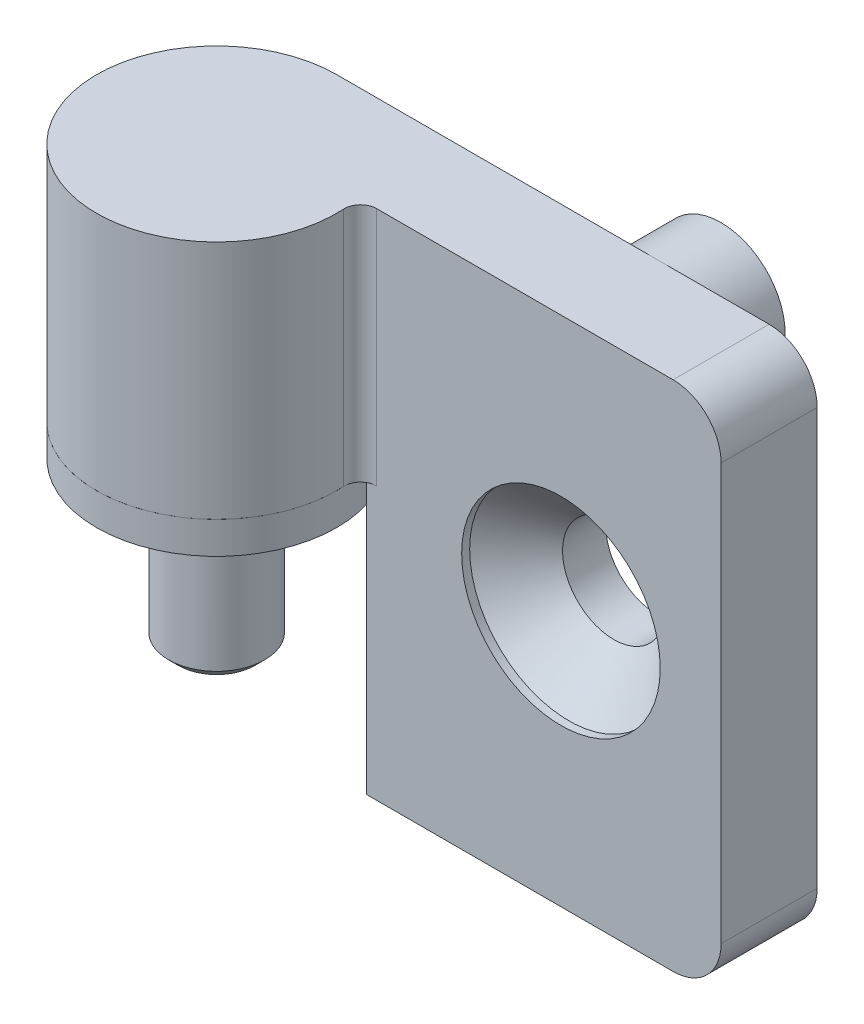
ISO-10303-21;
HEADER;
FILE_DESCRIPTION(('STEP AP214'),'2;1');
FILE_NAME('part.step','',(''),(''),'','','');
FILE_SCHEMA(('AUTOMOTIVE_DESIGN { 1 0 10303 214 1 1 1 1 }'));
ENDSEC;
DATA;
#1=APPLICATION_CONTEXT('core data for automotive mechanical design processes');
#2=APPLICATION_PROTOCOL_DEFINITION('international standard','automotive_design',2000,#1);
#3=PRODUCT_CONTEXT('',#1,'mechanical');
#4=PRODUCT('Part','Part','',(#3));
#5=PRODUCT_RELATED_PRODUCT_CATEGORY('part','',(#4));
#6=PRODUCT_DEFINITION_FORMATION('','',#4);
#7=PRODUCT_DEFINITION_CONTEXT('part definition',#1,'design');
#8=PRODUCT_DEFINITION('design','',#6,#7);
#9=PRODUCT_DEFINITION_SHAPE('','',#8);
#10=(LENGTH_UNIT() NAMED_UNIT(*) SI_UNIT(.MILLI.,.METRE.));
#11=(NAMED_UNIT(*) PLANE_ANGLE_UNIT() SI_UNIT($,.RADIAN.));
#12=(NAMED_UNIT(*) SI_UNIT($,.STERADIAN.) SOLID_ANGLE_UNIT());
#13=UNCERTAINTY_MEASURE_WITH_UNIT(LENGTH_MEASURE(1.E-05),#10,'distance_accuracy_value','');
#14=(GEOMETRIC_REPRESENTATION_CONTEXT(3) GLOBAL_UNCERTAINTY_ASSIGNED_CONTEXT((#13)) GLOBAL_UNIT_ASSIGNED_CONTEXT((#10,
#11,#12)) REPRESENTATION_CONTEXT('',''));
#15=CARTESIAN_POINT('',(0.,0.,0.));
#16=DIRECTION('',(0.,0.,1.));
#17=DIRECTION('',(1.,0.,0.));
#18=AXIS2_PLACEMENT_3D('',#15,#16,#17);
#19=CARTESIAN_POINT('',(0.,-11.,0.));
#20=DIRECTION('',(0.,-1.,0.));
#21=DIRECTION('',(0.,0.,-1.));
#22=AXIS2_PLACEMENT_3D('',#19,#20,#21);
#23=PLANE('',#22);
#24=CARTESIAN_POINT('',(0.,-11.0000000000241,0.));
#25=DIRECTION('',(0.,1.,0.));
#26=DIRECTION('',(0.,0.,1.));
#27=AXIS2_PLACEMENT_3D('',#24,#25,#26);
#28=CIRCLE('',#27,2.39999999996598);
#29=CARTESIAN_POINT('',(0.,-11.0000000000241,2.39999999996598));
#30=VERTEX_POINT('',#29);
#31=EDGE_CURVE('P0_E18',#30,#30,#28,.T.);
#32=ORIENTED_EDGE('',*,*,#31,.F.);
#33=EDGE_LOOP('',(#32));
#34=FACE_BOUND('',#33,.T.);
#35=ADVANCED_FACE('P0_F15',(#34),#23,.T.);
#36=CARTESIAN_POINT('',(0.,11.,0.));
#37=DIRECTION('',(0.,-1.,0.));
#38=DIRECTION('',(0.,0.,-1.));
#39=AXIS2_PLACEMENT_3D('',#36,#37,#38);
#40=PLANE('',#39);
#41=CARTESIAN_POINT('',(0.,11.0000000000241,0.));
#42=DIRECTION('',(0.,-1.,0.));
#43=DIRECTION('',(0.,0.,-1.));
#44=AXIS2_PLACEMENT_3D('',#41,#42,#43);
#45=CIRCLE('',#44,2.39999999996598);
#46=CARTESIAN_POINT('',(0.,11.0000000000241,-2.39999999996598));
#47=VERTEX_POINT('',#46);
#48=EDGE_CURVE('P0_E27',#47,#47,#45,.T.);
#49=ORIENTED_EDGE('',*,*,#48,.F.);
#50=EDGE_LOOP('',(#49));
#51=FACE_BOUND('',#50,.T.);
#52=ADVANCED_FACE('P0_F42',(#51),#40,.F.);
#53=CARTESIAN_POINT('',(0.,-10.400000000061,0.));
#54=DIRECTION('',(0.,1.,0.));
#55=DIRECTION('',(0.,0.,1.));
#56=AXIS2_PLACEMENT_3D('',#53,#54,#55);
#57=CONICAL_SURFACE('',#56,2.99999999992906,0.785398163397448);
#58=CARTESIAN_POINT('',(0.,-10.4,0.));
#59=DIRECTION('',(0.,1.,0.));
#60=DIRECTION('',(0.,0.,1.));
#61=AXIS2_PLACEMENT_3D('',#58,#59,#60);
#62=CIRCLE('',#61,3.);
#63=CARTESIAN_POINT('',(0.,-10.4,3.));
#64=VERTEX_POINT('',#63);
#65=EDGE_CURVE('P0_E22',#64,#64,#62,.T.);
#66=ORIENTED_EDGE('',*,*,#65,.F.);
#67=EDGE_LOOP('',(#66));
#68=FACE_BOUND('',#67,.T.);
#69=ORIENTED_EDGE('',*,*,#31,.T.);
#70=EDGE_LOOP('',(#69));
#71=FACE_BOUND('',#70,.T.);
#72=ADVANCED_FACE('P0_F39',(#68,#71),#57,.T.);
#73=CARTESIAN_POINT('',(0.,10.4000000000042,0.));
#74=DIRECTION('',(0.,-1.,0.));
#75=DIRECTION('',(0.,0.,-1.));
#76=AXIS2_PLACEMENT_3D('',#73,#74,#75);
#77=CONICAL_SURFACE('',#76,2.9999999999859,0.785398163397448);
#78=CARTESIAN_POINT('',(0.,10.4,0.));
#79=DIRECTION('',(0.,1.,0.));
#80=DIRECTION('',(0.,0.,1.));
#81=AXIS2_PLACEMENT_3D('',#78,#79,#80);
#82=CIRCLE('',#81,3.);
#83=CARTESIAN_POINT('',(0.,10.4,3.));
#84=VERTEX_POINT('',#83);
#85=EDGE_CURVE('P0_E10',#84,#84,#82,.F.);
#86=ORIENTED_EDGE('',*,*,#85,.F.);
#87=EDGE_LOOP('',(#86));
#88=FACE_BOUND('',#87,.T.);
#89=ORIENTED_EDGE('',*,*,#48,.T.);
#90=EDGE_LOOP('',(#89));
#91=FACE_BOUND('',#90,.T.);
#92=ADVANCED_FACE('P0_F50',(#88,#91),#77,.T.);
#93=CARTESIAN_POINT('',(0.,-11.,0.));
#94=DIRECTION('',(0.,1.,0.));
#95=DIRECTION('',(0.,0.,1.));
#96=AXIS2_PLACEMENT_3D('',#93,#94,#95);
#97=CYLINDRICAL_SURFACE('',#96,3.);
#98=ORIENTED_EDGE('',*,*,#85,.T.);
#99=EDGE_LOOP('',(#98));
#100=FACE_BOUND('',#99,.T.);
#101=ORIENTED_EDGE('',*,*,#65,.T.);
#102=EDGE_LOOP('',(#101));
#103=FACE_BOUND('',#102,.T.);
#104=ADVANCED_FACE('P0_F48',(#100,#103),#97,.T.);
#105=CLOSED_SHELL('',(#35,#52,#72,#92,#104));
#106=MANIFOLD_SOLID_BREP('P0_B1',#105);
#107=CARTESIAN_POINT('',(0.,1.,0.));
#108=DIRECTION('',(0.,-1.,0.));
#109=DIRECTION('',(0.,0.,-1.));
#110=AXIS2_PLACEMENT_3D('',#107,#108,#109);
#111=PLANE('',#110);
#112=CARTESIAN_POINT('',(0.,1.,0.));
#113=DIRECTION('',(0.,-1.,0.));
#114=DIRECTION('',(0.,0.,-1.));
#115=AXIS2_PLACEMENT_3D('',#112,#113,#114);
#116=CIRCLE('',#115,3.);
#117=CARTESIAN_POINT('',(0.,1.,-3.));
#118=VERTEX_POINT('',#117);
#119=EDGE_CURVE('P1_E26',#118,#118,#116,.T.);
#120=ORIENTED_EDGE('',*,*,#119,.T.);
#121=EDGE_LOOP('',(#120));
#122=FACE_BOUND('',#121,.T.);
#123=CARTESIAN_POINT('',(0.,1.,0.));
#124=DIRECTION('',(0.,1.,0.));
#125=DIRECTION('',(0.,0.,1.));
#126=AXIS2_PLACEMENT_3D('',#123,#124,#125);
#127=CIRCLE('',#126,7.5);
#128=CARTESIAN_POINT('',(0.,1.,7.5));
#129=VERTEX_POINT('',#128);
#130=EDGE_CURVE('P1_E17',#129,#129,#127,.F.);
#131=ORIENTED_EDGE('',*,*,#130,.F.);
#132=EDGE_LOOP('',(#131));
#133=FACE_BOUND('',#132,.T.);
#134=ADVANCED_FACE('P1_F14',(#122,#133),#111,.F.);
#135=CARTESIAN_POINT('',(0.,-1.,0.));
#136=DIRECTION('',(0.,1.,0.));
#137=DIRECTION('',(0.,0.,1.));
#138=AXIS2_PLACEMENT_3D('',#135,#136,#137);
#139=CYLINDRICAL_SURFACE('',#138,7.5);
#140=ORIENTED_EDGE('',*,*,#130,.T.);
#141=EDGE_LOOP('',(#140));
#142=FACE_BOUND('',#141,.T.);
#143=CARTESIAN_POINT('',(0.,-1.,0.));
#144=DIRECTION('',(0.,1.,0.));
#145=DIRECTION('',(0.,0.,1.));
#146=AXIS2_PLACEMENT_3D('',#143,#144,#145);
#147=CIRCLE('',#146,7.5);
#148=CARTESIAN_POINT('',(0.,-1.,7.5));
#149=VERTEX_POINT('',#148);
#150=EDGE_CURVE('P1_E21',#149,#149,#147,.F.);
#151=ORIENTED_EDGE('',*,*,#150,.F.);
#152=EDGE_LOOP('',(#151));
#153=FACE_BOUND('',#152,.T.);
#154=ADVANCED_FACE('P1_F34',(#142,#153),#139,.T.);
#155=CARTESIAN_POINT('',(0.,2.,0.));
#156=DIRECTION('',(0.,-1.,0.));
#157=DIRECTION('',(0.,0.,-1.));
#158=AXIS2_PLACEMENT_3D('',#155,#156,#157);
#159=CYLINDRICAL_SURFACE('',#158,3.);
#160=CARTESIAN_POINT('',(0.,-1.,0.));
#161=DIRECTION('',(0.,-1.,0.));
#162=DIRECTION('',(0.,0.,-1.));
#163=AXIS2_PLACEMENT_3D('',#160,#161,#162);
#164=CIRCLE('',#163,3.);
#165=CARTESIAN_POINT('',(0.,-1.,-3.));
#166=VERTEX_POINT('',#165);
#167=EDGE_CURVE('P1_E10',#166,#166,#164,.F.);
#168=ORIENTED_EDGE('',*,*,#167,.F.);
#169=EDGE_LOOP('',(#168));
#170=FACE_BOUND('',#169,.T.);
#171=ORIENTED_EDGE('',*,*,#119,.F.);
#172=EDGE_LOOP('',(#171));
#173=FACE_BOUND('',#172,.T.);
#174=ADVANCED_FACE('P1_F42',(#170,#173),#159,.F.);
#175=CARTESIAN_POINT('',(0.,-1.,0.));
#176=DIRECTION('',(0.,-1.,0.));
#177=DIRECTION('',(0.,0.,-1.));
#178=AXIS2_PLACEMENT_3D('',#175,#176,#177);
#179=PLANE('',#178);
#180=ORIENTED_EDGE('',*,*,#167,.T.);
#181=EDGE_LOOP('',(#180));
#182=FACE_BOUND('',#181,.T.);
#183=ORIENTED_EDGE('',*,*,#150,.T.);
#184=EDGE_LOOP('',(#183));
#185=FACE_BOUND('',#184,.T.);
#186=ADVANCED_FACE('P1_F43',(#182,#185),#179,.T.);
#187=CLOSED_SHELL('',(#134,#154,#174,#186));
#188=MANIFOLD_SOLID_BREP('P1_B1',#187);
#189=CARTESIAN_POINT('',(20.,-12.,-11.5));
#190=DIRECTION('',(0.,0.,1.));
#191=DIRECTION('',(1.,0.,0.));
#192=AXIS2_PLACEMENT_3D('',#189,#190,#191);
#193=CYLINDRICAL_SURFACE('',#192,4.);
#194=CARTESIAN_POINT('',(20.,-12.,-7.5));
#195=DIRECTION('',(0.,0.,1.));
#196=DIRECTION('',(1.,0.,0.));
#197=AXIS2_PLACEMENT_3D('',#194,#195,#196);
#198=CIRCLE('',#197,4.);
#199=CARTESIAN_POINT('',(16.2919007564522,-10.5,-7.5));
#200=VERTEX_POINT('',#199);
#201=CARTESIAN_POINT('',(20.,-16.,-7.5));
#202=VERTEX_POINT('',#201);
#203=EDGE_CURVE('P2_E140',#200,#202,#198,.T.);
#204=ORIENTED_EDGE('',*,*,#203,.F.);
#205=DIRECTION('',(0.,0.,1.));
#206=VECTOR('',#205,1.);
#207=CARTESIAN_POINT('',(16.2919007564522,-10.5,-11.5));
#208=LINE('',#207,#206);
#209=CARTESIAN_POINT('',(16.2919007564522,-10.5,-11.5));
#210=VERTEX_POINT('',#209);
#211=EDGE_CURVE('P2_E102',#200,#210,#208,.F.);
#212=ORIENTED_EDGE('',*,*,#211,.T.);
#213=CARTESIAN_POINT('',(20.,-12.,-11.5));
#214=DIRECTION('',(0.,0.,1.));
#215=DIRECTION('',(1.,0.,0.));
#216=AXIS2_PLACEMENT_3D('',#213,#214,#215);
#217=CIRCLE('',#216,4.);
#218=CARTESIAN_POINT('',(23.7080992435478,-10.5,-11.5));
#219=VERTEX_POINT('',#218);
#220=EDGE_CURVE('P2_E105',#210,#219,#217,.T.);
#221=ORIENTED_EDGE('',*,*,#220,.T.);
#222=DIRECTION('',(0.,0.,1.));
#223=VECTOR('',#222,1.);
#224=CARTESIAN_POINT('',(23.7080992435478,-10.5,-11.5));
#225=LINE('',#224,#223);
#226=CARTESIAN_POINT('',(23.7080992435478,-10.5,-7.5));
#227=VERTEX_POINT('',#226);
#228=EDGE_CURVE('P2_E108',#219,#227,#225,.T.);
#229=ORIENTED_EDGE('',*,*,#228,.T.);
#230=CARTESIAN_POINT('',(20.,-12.,-7.5));
#231=DIRECTION('',(0.,0.,1.));
#232=DIRECTION('',(1.,0.,0.));
#233=AXIS2_PLACEMENT_3D('',#230,#231,#232);
#234=CIRCLE('',#233,4.);
#235=EDGE_CURVE('P2_E138',#202,#227,#234,.T.);
#236=ORIENTED_EDGE('',*,*,#235,.F.);
#237=EDGE_LOOP('',(#204,#212,#221,#229,#236));
#238=FACE_BOUND('',#237,.T.);
#239=ADVANCED_FACE('P2_F16',(#238),#193,.T.);
#240=CARTESIAN_POINT('',(23.7080992435478,-10.5,-11.5));
#241=DIRECTION('',(0.,1.,0.));
#242=DIRECTION('',(0.,0.,1.));
#243=AXIS2_PLACEMENT_3D('',#240,#241,#242);
#244=PLANE('',#243);
#245=DIRECTION('',(1.,0.,0.));
#246=VECTOR('',#245,1.);
#247=CARTESIAN_POINT('',(23.7080992435478,-10.5,-11.5));
#248=LINE('',#247,#246);
#249=EDGE_CURVE('P2_E115',#219,#210,#248,.F.);
#250=ORIENTED_EDGE('',*,*,#249,.T.);
#251=ORIENTED_EDGE('',*,*,#211,.F.);
#252=DIRECTION('',(1.,0.,0.));
#253=VECTOR('',#252,1.);
#254=CARTESIAN_POINT('',(20.,-10.5,-7.5));
#255=LINE('',#254,#253);
#256=EDGE_CURVE('P2_E20',#200,#227,#255,.T.);
#257=ORIENTED_EDGE('',*,*,#256,.T.);
#258=ORIENTED_EDGE('',*,*,#228,.F.);
#259=EDGE_LOOP('',(#250,#251,#257,#258));
#260=FACE_BOUND('',#259,.T.);
#261=ADVANCED_FACE('P2_F114',(#260),#244,.T.);
#262=CARTESIAN_POINT('',(20.,-12.,-11.5));
#263=DIRECTION('',(0.,0.,1.));
#264=DIRECTION('',(1.,0.,0.));
#265=AXIS2_PLACEMENT_3D('',#262,#263,#264);
#266=PLANE('',#265);
#267=ORIENTED_EDGE('',*,*,#249,.F.);
#268=ORIENTED_EDGE('',*,*,#220,.F.);
#269=EDGE_LOOP('',(#267,#268));
#270=FACE_BOUND('',#269,.T.);
#271=ADVANCED_FACE('P2_F18',(#270),#266,.F.);
#272=CARTESIAN_POINT('',(20.,12.,-11.5));
#273=DIRECTION('',(0.,0.,1.));
#274=DIRECTION('',(1.,0.,0.));
#275=AXIS2_PLACEMENT_3D('',#272,#273,#274);
#276=CYLINDRICAL_SURFACE('',#275,4.);
#277=CARTESIAN_POINT('',(20.,12.,-7.5));
#278=DIRECTION('',(0.,0.,1.));
#279=DIRECTION('',(1.,0.,0.));
#280=AXIS2_PLACEMENT_3D('',#277,#278,#279);
#281=CIRCLE('',#280,4.);
#282=CARTESIAN_POINT('',(23.7080992435478,10.5,-7.5));
#283=VERTEX_POINT('',#282);
#284=CARTESIAN_POINT('',(20.,16.,-7.5));
#285=VERTEX_POINT('',#284);
#286=EDGE_CURVE('P2_E128',#283,#285,#281,.T.);
#287=ORIENTED_EDGE('',*,*,#286,.F.);
#288=DIRECTION('',(0.,0.,1.));
#289=VECTOR('',#288,1.);
#290=CARTESIAN_POINT('',(23.7080992435478,10.5,-11.5));
#291=LINE('',#290,#289);
#292=CARTESIAN_POINT('',(23.7080992435478,10.5,-11.5));
#293=VERTEX_POINT('',#292);
#294=EDGE_CURVE('P2_E117',#283,#293,#291,.F.);
#295=ORIENTED_EDGE('',*,*,#294,.T.);
#296=CARTESIAN_POINT('',(20.,12.,-11.5));
#297=DIRECTION('',(0.,0.,1.));
#298=DIRECTION('',(1.,0.,0.));
#299=AXIS2_PLACEMENT_3D('',#296,#297,#298);
#300=CIRCLE('',#299,4.);
#301=CARTESIAN_POINT('',(16.2919007564522,10.5,-11.5));
#302=VERTEX_POINT('',#301);
#303=EDGE_CURVE('P2_E119',#293,#302,#300,.T.);
#304=ORIENTED_EDGE('',*,*,#303,.T.);
#305=DIRECTION('',(0.,0.,1.));
#306=VECTOR('',#305,1.);
#307=CARTESIAN_POINT('',(16.2919007564522,10.5,-11.5));
#308=LINE('',#307,#306);
#309=CARTESIAN_POINT('',(16.2919007564522,10.5,-7.5));
#310=VERTEX_POINT('',#309);
#311=EDGE_CURVE('P2_E221',#302,#310,#308,.T.);
#312=ORIENTED_EDGE('',*,*,#311,.T.);
#313=CARTESIAN_POINT('',(20.,12.,-7.5));
#314=DIRECTION('',(0.,0.,1.));
#315=DIRECTION('',(1.,0.,0.));
#316=AXIS2_PLACEMENT_3D('',#313,#314,#315);
#317=CIRCLE('',#316,4.);
#318=EDGE_CURVE('P2_E124',#285,#310,#317,.T.);
#319=ORIENTED_EDGE('',*,*,#318,.F.);
#320=EDGE_LOOP('',(#287,#295,#304,#312,#319));
#321=FACE_BOUND('',#320,.T.);
#322=ADVANCED_FACE('P2_F219',(#321),#276,.T.);
#323=CARTESIAN_POINT('',(16.2919007564522,10.5,-11.5));
#324=DIRECTION('',(0.,-1.,0.));
#325=DIRECTION('',(0.,0.,-1.));
#326=AXIS2_PLACEMENT_3D('',#323,#324,#325);
#327=PLANE('',#326);
#328=DIRECTION('',(1.,0.,0.));
#329=VECTOR('',#328,1.);
#330=CARTESIAN_POINT('',(16.2919007564522,10.5,-11.5));
#331=LINE('',#330,#329);
#332=EDGE_CURVE('P2_E228',#302,#293,#331,.T.);
#333=ORIENTED_EDGE('',*,*,#332,.T.);
#334=ORIENTED_EDGE('',*,*,#294,.F.);
#335=DIRECTION('',(1.,0.,0.));
#336=VECTOR('',#335,1.);
#337=CARTESIAN_POINT('',(20.,10.5,-7.5));
#338=LINE('',#337,#336);
#339=EDGE_CURVE('P2_E127',#310,#283,#338,.T.);
#340=ORIENTED_EDGE('',*,*,#339,.F.);
#341=ORIENTED_EDGE('',*,*,#311,.F.);
#342=EDGE_LOOP('',(#333,#334,#340,#341));
#343=FACE_BOUND('',#342,.T.);
#344=ADVANCED_FACE('P2_F226',(#343),#327,.T.);
#345=CARTESIAN_POINT('',(20.,12.,-11.5));
#346=DIRECTION('',(0.,0.,1.));
#347=DIRECTION('',(1.,0.,0.));
#348=AXIS2_PLACEMENT_3D('',#345,#346,#347);
#349=PLANE('',#348);
#350=ORIENTED_EDGE('',*,*,#332,.F.);
#351=ORIENTED_EDGE('',*,*,#303,.F.);
#352=EDGE_LOOP('',(#350,#351));
#353=FACE_BOUND('',#352,.T.);
#354=ADVANCED_FACE('P2_F231',(#353),#349,.F.);
#355=CARTESIAN_POINT('',(20.,0.,-1.49999999999999));
#356=DIRECTION('',(0.,0.,-1.));
#357=DIRECTION('',(-1.,0.,0.));
#358=AXIS2_PLACEMENT_3D('',#355,#356,#357);
#359=CYLINDRICAL_SURFACE('',#358,3.20000000000001);
#360=CARTESIAN_POINT('',(20.,0.,-7.5));
#361=DIRECTION('',(0.,0.,-1.));
#362=DIRECTION('',(-1.,0.,0.));
#363=AXIS2_PLACEMENT_3D('',#360,#361,#362);
#364=CIRCLE('',#363,3.20000000000001);
#365=CARTESIAN_POINT('',(16.8,0.,-7.5));
#366=VERTEX_POINT('',#365);
#367=EDGE_CURVE('P2_E10',#366,#366,#364,.T.);
#368=ORIENTED_EDGE('',*,*,#367,.T.);
#369=EDGE_LOOP('',(#368));
#370=FACE_BOUND('',#369,.T.);
#371=CARTESIAN_POINT('',(20.,0.,-4.79999999999999));
#372=DIRECTION('',(0.,0.,-1.));
#373=DIRECTION('',(-1.,0.,0.));
#374=AXIS2_PLACEMENT_3D('',#371,#372,#373);
#375=CIRCLE('',#374,3.20000000000001);
#376=CARTESIAN_POINT('',(16.8,0.,-4.79999999999999));
#377=VERTEX_POINT('',#376);
#378=EDGE_CURVE('P2_E236',#377,#377,#375,.T.);
#379=ORIENTED_EDGE('',*,*,#378,.F.);
#380=EDGE_LOOP('',(#379));
#381=FACE_BOUND('',#380,.T.);
#382=ADVANCED_FACE('P2_F310',(#370,#381),#359,.F.);
#383=CARTESIAN_POINT('',(20.,0.,-2.00000000012324));
#384=DIRECTION('',(0.,0.,1.));
#385=DIRECTION('',(1.,0.,0.));
#386=AXIS2_PLACEMENT_3D('',#383,#384,#385);
#387=CONICAL_SURFACE('',#386,6.19999999990341,0.819867264398306);
#388=CARTESIAN_POINT('',(20.,0.,-2.00000000000955));
#389=DIRECTION('',(0.,0.,1.));
#390=DIRECTION('',(1.,0.,0.));
#391=AXIS2_PLACEMENT_3D('',#388,#389,#390);
#392=CIRCLE('',#391,6.19999999996026);
#393=CARTESIAN_POINT('',(26.1999999999603,0.,-2.00000000000955));
#394=VERTEX_POINT('',#393);
#395=EDGE_CURVE('P2_E490',#394,#394,#392,.F.);
#396=ORIENTED_EDGE('',*,*,#395,.F.);
#397=EDGE_LOOP('',(#396));
#398=FACE_BOUND('',#397,.T.);
#399=ORIENTED_EDGE('',*,*,#378,.T.);
#400=EDGE_LOOP('',(#399));
#401=FACE_BOUND('',#400,.T.);
#402=ADVANCED_FACE('P2_F313',(#398,#401),#387,.F.);
#403=CARTESIAN_POINT('',(20.,0.,-1.49999999999999));
#404=DIRECTION('',(0.,0.,-1.));
#405=DIRECTION('',(-1.,0.,0.));
#406=AXIS2_PLACEMENT_3D('',#403,#404,#405);
#407=CYLINDRICAL_SURFACE('',#406,6.2);
#408=ORIENTED_EDGE('',*,*,#395,.T.);
#409=EDGE_LOOP('',(#408));
#410=FACE_BOUND('',#409,.T.);
#411=CARTESIAN_POINT('',(20.,0.,-1.49999999999999));
#412=DIRECTION('',(0.,0.,-1.));
#413=DIRECTION('',(-1.,0.,0.));
#414=AXIS2_PLACEMENT_3D('',#411,#412,#413);
#415=CIRCLE('',#414,6.2);
#416=CARTESIAN_POINT('',(13.8,0.,-1.49999999999999));
#417=VERTEX_POINT('',#416);
#418=EDGE_CURVE('P2_E178',#417,#417,#415,.F.);
#419=ORIENTED_EDGE('',*,*,#418,.T.);
#420=EDGE_LOOP('',(#419));
#421=FACE_BOUND('',#420,.T.);
#422=ADVANCED_FACE('P2_F317',(#410,#421),#407,.F.);
#423=CARTESIAN_POINT('',(0.,-16.,0.));
#424=DIRECTION('',(0.,1.,0.));
#425=DIRECTION('',(0.,0.,1.));
#426=AXIS2_PLACEMENT_3D('',#423,#424,#425);
#427=PLANE('',#426);
#428=CARTESIAN_POINT('',(0.,-16.,0.));
#429=DIRECTION('',(0.,1.,0.));
#430=DIRECTION('',(0.,0.,1.));
#431=AXIS2_PLACEMENT_3D('',#428,#429,#430);
#432=CIRCLE('',#431,8.);
#433=CARTESIAN_POINT('',(2.78388218141501,-16.,-7.5));
#434=VERTEX_POINT('',#433);
#435=CARTESIAN_POINT('',(7.85811682275086,-16.,-1.5));
#436=VERTEX_POINT('',#435);
#437=EDGE_CURVE('P2_E172',#434,#436,#432,.F.);
#438=ORIENTED_EDGE('',*,*,#437,.F.);
#439=DIRECTION('',(1.,0.,0.));
#440=VECTOR('',#439,1.);
#441=CARTESIAN_POINT('',(14.8919410907075,-16.,-7.5));
#442=LINE('',#441,#440);
#443=EDGE_CURVE('P2_E26',#434,#202,#442,.T.);
#444=ORIENTED_EDGE('',*,*,#443,.T.);
#445=DIRECTION('',(1.,0.,0.));
#446=VECTOR('',#445,1.);
#447=CARTESIAN_POINT('',(14.8919410907075,-16.,-7.5));
#448=LINE('',#447,#446);
#449=CARTESIAN_POINT('',(27.,-16.,-7.5));
#450=VERTEX_POINT('',#449);
#451=EDGE_CURVE('P2_E137',#202,#450,#448,.T.);
#452=ORIENTED_EDGE('',*,*,#451,.T.);
#453=DIRECTION('',(0.,0.,1.));
#454=VECTOR('',#453,1.);
#455=CARTESIAN_POINT('',(27.,-16.,0.));
#456=LINE('',#455,#454);
#457=CARTESIAN_POINT('',(27.,-16.,-1.5));
#458=VERTEX_POINT('',#457);
#459=EDGE_CURVE('P2_E166',#458,#450,#456,.F.);
#460=ORIENTED_EDGE('',*,*,#459,.F.);
#461=DIRECTION('',(1.,0.,0.));
#462=VECTOR('',#461,1.);
#463=CARTESIAN_POINT('',(0.,-16.,-1.5));
#464=LINE('',#463,#462);
#465=EDGE_CURVE('P2_E174',#436,#458,#464,.T.);
#466=ORIENTED_EDGE('',*,*,#465,.F.);
#467=EDGE_LOOP('',(#438,#444,#452,#460,#466));
#468=FACE_BOUND('',#467,.T.);
#469=ADVANCED_FACE('P2_F163',(#468),#427,.F.);
#470=CARTESIAN_POINT('',(0.,-16.,0.));
#471=DIRECTION('',(0.,1.,0.));
#472=DIRECTION('',(0.,0.,1.));
#473=AXIS2_PLACEMENT_3D('',#470,#471,#472);
#474=CYLINDRICAL_SURFACE('',#473,8.);
#475=CARTESIAN_POINT('',(0.,1.,0.));
#476=DIRECTION('',(0.,1.,0.));
#477=DIRECTION('',(0.,0.,1.));
#478=AXIS2_PLACEMENT_3D('',#475,#476,#477);
#479=CIRCLE('',#478,8.);
#480=CARTESIAN_POINT('',(2.78388201474834,1.,-7.5));
#481=VERTEX_POINT('',#480);
#482=CARTESIAN_POINT('',(7.85811682275086,1.,-1.5));
#483=VERTEX_POINT('',#482);
#484=EDGE_CURVE('P2_E182',#481,#483,#479,.F.);
#485=ORIENTED_EDGE('',*,*,#484,.F.);
#486=DIRECTION('',(0.,1.,0.));
#487=VECTOR('',#486,1.);
#488=CARTESIAN_POINT('',(2.78388218141501,-7.5,-7.5));
#489=LINE('',#488,#487);
#490=EDGE_CURVE('P2_E145',#434,#481,#489,.T.);
#491=ORIENTED_EDGE('',*,*,#490,.F.);
#492=ORIENTED_EDGE('',*,*,#437,.T.);
#493=DIRECTION('',(0.,1.,0.));
#494=VECTOR('',#493,1.);
#495=CARTESIAN_POINT('',(7.85811682275086,-16.,-1.5));
#496=LINE('',#495,#494);
#497=EDGE_CURVE('P2_E184',#483,#436,#496,.F.);
#498=ORIENTED_EDGE('',*,*,#497,.F.);
#499=EDGE_LOOP('',(#485,#491,#492,#498));
#500=FACE_BOUND('',#499,.T.);
#501=ADVANCED_FACE('P2_F180',(#500),#474,.F.);
#502=CARTESIAN_POINT('',(0.,1.,0.));
#503=DIRECTION('',(0.,1.,0.));
#504=DIRECTION('',(0.,0.,1.));
#505=AXIS2_PLACEMENT_3D('',#502,#503,#504);
#506=PLANE('',#505);
#507=CARTESIAN_POINT('',(0.,1.,0.));
#508=DIRECTION('',(0.,-1.,0.));
#509=DIRECTION('',(0.,0.,-1.));
#510=AXIS2_PLACEMENT_3D('',#507,#508,#509);
#511=CIRCLE('',#510,3.);
#512=CARTESIAN_POINT('',(0.,1.,-3.));
#513=VERTEX_POINT('',#512);
#514=EDGE_CURVE('P2_E252',#513,#513,#511,.T.);
#515=ORIENTED_EDGE('',*,*,#514,.F.);
#516=EDGE_LOOP('',(#515));
#517=FACE_BOUND('',#516,.T.);
#518=CARTESIAN_POINT('',(0.,1.,0.));
#519=DIRECTION('',(0.,-1.,0.));
#520=DIRECTION('',(0.,0.,-1.));
#521=AXIS2_PLACEMENT_3D('',#518,#519,#520);
#522=CIRCLE('',#521,7.5);
#523=CARTESIAN_POINT('',(0.,1.00000016666667,-7.5));
#524=VERTEX_POINT('',#523);
#525=CARTESIAN_POINT('',(7.48701297726933,1.,-0.441176470588234));
#526=VERTEX_POINT('',#525);
#527=EDGE_CURVE('P2_E193',#524,#526,#522,.F.);
#528=ORIENTED_EDGE('',*,*,#527,.F.);
#529=DIRECTION('',(1.,0.,0.));
#530=VECTOR('',#529,1.);
#531=CARTESIAN_POINT('',(1.3919410907075,1.,-7.5));
#532=LINE('',#531,#530);
#533=EDGE_CURVE('P2_E147',#524,#481,#532,.T.);
#534=ORIENTED_EDGE('',*,*,#533,.T.);
#535=ORIENTED_EDGE('',*,*,#484,.T.);
#536=DIRECTION('',(1.,0.,0.));
#537=VECTOR('',#536,1.);
#538=CARTESIAN_POINT('',(0.,1.,-1.5));
#539=LINE('',#538,#537);
#540=CARTESIAN_POINT('',(8.48528137423857,1.,-1.5));
#541=VERTEX_POINT('',#540);
#542=EDGE_CURVE('P2_E255',#541,#483,#539,.F.);
#543=ORIENTED_EDGE('',*,*,#542,.F.);
#544=CARTESIAN_POINT('',(8.48528137423857,1.,-0.499999999999997));
#545=DIRECTION('',(0.,-1.,0.));
#546=DIRECTION('',(0.,0.,-1.));
#547=AXIS2_PLACEMENT_3D('',#544,#545,#546);
#548=CIRCLE('',#547,1.);
#549=EDGE_CURVE('P2_E257',#541,#526,#548,.F.);
#550=ORIENTED_EDGE('',*,*,#549,.T.);
#551=EDGE_LOOP('',(#528,#534,#535,#543,#550));
#552=FACE_BOUND('',#551,.T.);
#553=ADVANCED_FACE('P2_F190',(#517,#552),#506,.F.);
#554=CARTESIAN_POINT('',(0.,16.,0.));
#555=DIRECTION('',(0.,-1.,0.));
#556=DIRECTION('',(0.,0.,-1.));
#557=AXIS2_PLACEMENT_3D('',#554,#555,#556);
#558=CYLINDRICAL_SURFACE('',#557,7.5);
#559=DIRECTION('',(0.,-1.,0.));
#560=VECTOR('',#559,1.);
#561=CARTESIAN_POINT('',(7.48701297726932,16.,-0.441176470588235));
#562=LINE('',#561,#560);
#563=CARTESIAN_POINT('',(7.48701297726933,16.,-0.441176470588234));
#564=VERTEX_POINT('',#563);
#565=EDGE_CURVE('P2_E204',#526,#564,#562,.F.);
#566=ORIENTED_EDGE('',*,*,#565,.T.);
#567=CARTESIAN_POINT('',(0.,16.,0.));
#568=DIRECTION('',(0.,-1.,0.));
#569=DIRECTION('',(0.,0.,-1.));
#570=AXIS2_PLACEMENT_3D('',#567,#568,#569);
#571=CIRCLE('',#570,7.5);
#572=CARTESIAN_POINT('',(0.,16.,-7.5));
#573=VERTEX_POINT('',#572);
#574=EDGE_CURVE('P2_E200',#564,#573,#571,.T.);
#575=ORIENTED_EDGE('',*,*,#574,.T.);
#576=DIRECTION('',(0.,-1.,0.));
#577=VECTOR('',#576,1.);
#578=CARTESIAN_POINT('',(0.,8.5,-7.5));
#579=LINE('',#578,#577);
#580=EDGE_CURVE('P2_E150',#573,#524,#579,.T.);
#581=ORIENTED_EDGE('',*,*,#580,.T.);
#582=ORIENTED_EDGE('',*,*,#527,.T.);
#583=EDGE_LOOP('',(#566,#575,#581,#582));
#584=FACE_BOUND('',#583,.T.);
#585=ADVANCED_FACE('P2_F201',(#584),#558,.T.);
#586=CARTESIAN_POINT('',(0.,16.,0.));
#587=DIRECTION('',(0.,1.,0.));
#588=DIRECTION('',(0.,0.,1.));
#589=AXIS2_PLACEMENT_3D('',#586,#587,#588);
#590=PLANE('',#589);
#591=ORIENTED_EDGE('',*,*,#574,.F.);
#592=CARTESIAN_POINT('',(8.48528137423857,16.,-0.499999999999997));
#593=DIRECTION('',(0.,-1.,0.));
#594=DIRECTION('',(0.,0.,-1.));
#595=AXIS2_PLACEMENT_3D('',#592,#593,#594);
#596=CIRCLE('',#595,1.);
#597=CARTESIAN_POINT('',(8.48528137423857,16.,-1.5));
#598=VERTEX_POINT('',#597);
#599=EDGE_CURVE('P2_E208',#564,#598,#596,.T.);
#600=ORIENTED_EDGE('',*,*,#599,.T.);
#601=DIRECTION('',(1.,0.,0.));
#602=VECTOR('',#601,1.);
#603=CARTESIAN_POINT('',(0.,16.,-1.5));
#604=LINE('',#603,#602);
#605=CARTESIAN_POINT('',(27.,16.,-1.5));
#606=VERTEX_POINT('',#605);
#607=EDGE_CURVE('P2_E240',#598,#606,#604,.T.);
#608=ORIENTED_EDGE('',*,*,#607,.T.);
#609=DIRECTION('',(0.,0.,1.));
#610=VECTOR('',#609,1.);
#611=CARTESIAN_POINT('',(27.,16.,0.));
#612=LINE('',#611,#610);
#613=CARTESIAN_POINT('',(27.,16.,-7.5));
#614=VERTEX_POINT('',#613);
#615=EDGE_CURVE('P2_E215',#606,#614,#612,.F.);
#616=ORIENTED_EDGE('',*,*,#615,.T.);
#617=DIRECTION('',(1.,0.,0.));
#618=VECTOR('',#617,1.);
#619=CARTESIAN_POINT('',(23.5,16.,-7.5));
#620=LINE('',#619,#618);
#621=EDGE_CURVE('P2_E130',#285,#614,#620,.T.);
#622=ORIENTED_EDGE('',*,*,#621,.F.);
#623=DIRECTION('',(1.,0.,0.));
#624=VECTOR('',#623,1.);
#625=CARTESIAN_POINT('',(10.,16.,-7.5));
#626=LINE('',#625,#624);
#627=EDGE_CURVE('P2_E126',#573,#285,#626,.T.);
#628=ORIENTED_EDGE('',*,*,#627,.F.);
#629=EDGE_LOOP('',(#591,#600,#608,#616,#622,#628));
#630=FACE_BOUND('',#629,.T.);
#631=ADVANCED_FACE('P2_F210',(#630),#590,.T.);
#632=CARTESIAN_POINT('',(27.,13.,-10.));
#633=DIRECTION('',(0.,0.,1.));
#634=DIRECTION('',(1.,0.,0.));
#635=AXIS2_PLACEMENT_3D('',#632,#633,#634);
#636=CYLINDRICAL_SURFACE('',#635,3.);
#637=ORIENTED_EDGE('',*,*,#615,.F.);
#638=CARTESIAN_POINT('',(27.,13.,-1.5));
#639=DIRECTION('',(0.,0.,1.));
#640=DIRECTION('',(1.,0.,0.));
#641=AXIS2_PLACEMENT_3D('',#638,#639,#640);
#642=CIRCLE('',#641,3.);
#643=CARTESIAN_POINT('',(30.,13.,-1.5));
#644=VERTEX_POINT('',#643);
#645=EDGE_CURVE('P2_E239',#606,#644,#642,.F.);
#646=ORIENTED_EDGE('',*,*,#645,.T.);
#647=DIRECTION('',(0.,0.,1.));
#648=VECTOR('',#647,1.);
#649=CARTESIAN_POINT('',(30.,13.,-10.));
#650=LINE('',#649,#648);
#651=CARTESIAN_POINT('',(30.,13.,-7.5));
#652=VERTEX_POINT('',#651);
#653=EDGE_CURVE('P2_E241',#644,#652,#650,.F.);
#654=ORIENTED_EDGE('',*,*,#653,.T.);
#655=CARTESIAN_POINT('',(27.,13.,-7.5));
#656=DIRECTION('',(0.,0.,1.));
#657=DIRECTION('',(1.,0.,0.));
#658=AXIS2_PLACEMENT_3D('',#655,#656,#657);
#659=CIRCLE('',#658,3.);
#660=EDGE_CURVE('P2_E131',#652,#614,#659,.T.);
#661=ORIENTED_EDGE('',*,*,#660,.T.);
#662=EDGE_LOOP('',(#637,#646,#654,#661));
#663=FACE_BOUND('',#662,.T.);
#664=ADVANCED_FACE('P2_F286',(#663),#636,.T.);
#665=CARTESIAN_POINT('',(30.,16.,-1.5));
#666=DIRECTION('',(-1.,0.,0.));
#667=DIRECTION('',(0.,0.,1.));
#668=AXIS2_PLACEMENT_3D('',#665,#666,#667);
#669=PLANE('',#668);
#670=DIRECTION('',(0.,0.,1.));
#671=VECTOR('',#670,1.);
#672=CARTESIAN_POINT('',(30.,-13.,-1.5));
#673=LINE('',#672,#671);
#674=CARTESIAN_POINT('',(30.,-13.,-7.5));
#675=VERTEX_POINT('',#674);
#676=CARTESIAN_POINT('',(30.,-13.,-1.5));
#677=VERTEX_POINT('',#676);
#678=EDGE_CURVE('P2_E77',#675,#677,#673,.T.);
#679=ORIENTED_EDGE('',*,*,#678,.F.);
#680=DIRECTION('',(0.,1.,0.));
#681=VECTOR('',#680,1.);
#682=CARTESIAN_POINT('',(30.,0.,-7.5));
#683=LINE('',#682,#681);
#684=EDGE_CURVE('P2_E134',#675,#652,#683,.T.);
#685=ORIENTED_EDGE('',*,*,#684,.T.);
#686=ORIENTED_EDGE('',*,*,#653,.F.);
#687=DIRECTION('',(0.,1.,0.));
#688=VECTOR('',#687,1.);
#689=CARTESIAN_POINT('',(30.,16.,-1.5));
#690=LINE('',#689,#688);
#691=EDGE_CURVE('P2_E244',#677,#644,#690,.T.);
#692=ORIENTED_EDGE('',*,*,#691,.F.);
#693=EDGE_LOOP('',(#679,#685,#686,#692));
#694=FACE_BOUND('',#693,.T.);
#695=ADVANCED_FACE('P2_F288',(#694),#669,.F.);
#696=CARTESIAN_POINT('',(27.,-13.,-10.));
#697=DIRECTION('',(0.,0.,1.));
#698=DIRECTION('',(1.,0.,0.));
#699=AXIS2_PLACEMENT_3D('',#696,#697,#698);
#700=CYLINDRICAL_SURFACE('',#699,3.00000000000001);
#701=ORIENTED_EDGE('',*,*,#678,.T.);
#702=CARTESIAN_POINT('',(27.,-13.,-1.5));
#703=DIRECTION('',(0.,0.,1.));
#704=DIRECTION('',(1.,0.,0.));
#705=AXIS2_PLACEMENT_3D('',#702,#703,#704);
#706=CIRCLE('',#705,3.00000000000001);
#707=EDGE_CURVE('P2_E265',#677,#458,#706,.F.);
#708=ORIENTED_EDGE('',*,*,#707,.T.);
#709=ORIENTED_EDGE('',*,*,#459,.T.);
#710=CARTESIAN_POINT('',(27.,-13.,-7.5));
#711=DIRECTION('',(0.,0.,1.));
#712=DIRECTION('',(1.,0.,0.));
#713=AXIS2_PLACEMENT_3D('',#710,#711,#712);
#714=CIRCLE('',#713,3.00000000000001);
#715=EDGE_CURVE('P2_E135',#450,#675,#714,.T.);
#716=ORIENTED_EDGE('',*,*,#715,.T.);
#717=EDGE_LOOP('',(#701,#708,#709,#716));
#718=FACE_BOUND('',#717,.T.);
#719=ADVANCED_FACE('P2_F289',(#718),#700,.T.);
#720=CARTESIAN_POINT('',(8.48528137423857,16.,-1.5));
#721=DIRECTION('',(0.,0.,-1.));
#722=DIRECTION('',(-1.,0.,0.));
#723=AXIS2_PLACEMENT_3D('',#720,#721,#722);
#724=PLANE('',#723);
#725=ORIENTED_EDGE('',*,*,#418,.F.);
#726=EDGE_LOOP('',(#725));
#727=FACE_BOUND('',#726,.T.);
#728=ORIENTED_EDGE('',*,*,#707,.F.);
#729=ORIENTED_EDGE('',*,*,#691,.T.);
#730=ORIENTED_EDGE('',*,*,#645,.F.);
#731=ORIENTED_EDGE('',*,*,#607,.F.);
#732=DIRECTION('',(0.,1.,0.));
#733=VECTOR('',#732,1.);
#734=CARTESIAN_POINT('',(8.48528137423857,16.,-1.5));
#735=LINE('',#734,#733);
#736=EDGE_CURVE('P2_E267',#541,#598,#735,.T.);
#737=ORIENTED_EDGE('',*,*,#736,.F.);
#738=ORIENTED_EDGE('',*,*,#542,.T.);
#739=ORIENTED_EDGE('',*,*,#497,.T.);
#740=ORIENTED_EDGE('',*,*,#465,.T.);
#741=EDGE_LOOP('',(#728,#729,#730,#731,#737,#738,#739,#740));
#742=FACE_BOUND('',#741,.T.);
#743=ADVANCED_FACE('P2_F283',(#727,#742),#724,.F.);
#744=CARTESIAN_POINT('',(8.48528137423857,16.,-0.499999999999997));
#745=DIRECTION('',(0.,-1.,0.));
#746=DIRECTION('',(0.,0.,-1.));
#747=AXIS2_PLACEMENT_3D('',#744,#745,#746);
#748=CYLINDRICAL_SURFACE('',#747,1.);
#749=ORIENTED_EDGE('',*,*,#736,.T.);
#750=ORIENTED_EDGE('',*,*,#599,.F.);
#751=ORIENTED_EDGE('',*,*,#565,.F.);
#752=ORIENTED_EDGE('',*,*,#549,.F.);
#753=EDGE_LOOP('',(#749,#750,#751,#752));
#754=FACE_BOUND('',#753,.T.);
#755=ADVANCED_FACE('P2_F277',(#754),#748,.F.);
#756=CARTESIAN_POINT('',(0.,12.,0.));
#757=DIRECTION('',(0.,-1.,0.));
#758=DIRECTION('',(0.,0.,-1.));
#759=AXIS2_PLACEMENT_3D('',#756,#757,#758);
#760=CYLINDRICAL_SURFACE('',#759,3.);
#761=ORIENTED_EDGE('',*,*,#514,.T.);
#762=EDGE_LOOP('',(#761));
#763=FACE_BOUND('',#762,.T.);
#764=CARTESIAN_POINT('',(0.,12.,0.));
#765=DIRECTION('',(0.,-1.,0.));
#766=DIRECTION('',(0.,0.,-1.));
#767=AXIS2_PLACEMENT_3D('',#764,#765,#766);
#768=CIRCLE('',#767,3.);
#769=CARTESIAN_POINT('',(0.,12.,-3.));
#770=VERTEX_POINT('',#769);
#771=EDGE_CURVE('P2_E142',#770,#770,#768,.T.);
#772=ORIENTED_EDGE('',*,*,#771,.F.);
#773=EDGE_LOOP('',(#772));
#774=FACE_BOUND('',#773,.T.);
#775=ADVANCED_FACE('P2_F306',(#763,#774),#760,.F.);
#776=CARTESIAN_POINT('',(0.,12.,0.));
#777=DIRECTION('',(0.,1.,0.));
#778=DIRECTION('',(0.,0.,1.));
#779=AXIS2_PLACEMENT_3D('',#776,#777,#778);
#780=PLANE('',#779);
#781=ORIENTED_EDGE('',*,*,#771,.T.);
#782=EDGE_LOOP('',(#781));
#783=FACE_BOUND('',#782,.T.);
#784=ADVANCED_FACE('P2_F301',(#783),#780,.F.);
#785=CARTESIAN_POINT('',(30.,16.,-7.5));
#786=DIRECTION('',(0.,0.,1.));
#787=DIRECTION('',(1.,0.,0.));
#788=AXIS2_PLACEMENT_3D('',#785,#786,#787);
#789=PLANE('',#788);
#790=ORIENTED_EDGE('',*,*,#203,.T.);
#791=ORIENTED_EDGE('',*,*,#443,.F.);
#792=ORIENTED_EDGE('',*,*,#490,.T.);
#793=ORIENTED_EDGE('',*,*,#533,.F.);
#794=ORIENTED_EDGE('',*,*,#580,.F.);
#795=ORIENTED_EDGE('',*,*,#627,.T.);
#796=ORIENTED_EDGE('',*,*,#318,.T.);
#797=ORIENTED_EDGE('',*,*,#339,.T.);
#798=ORIENTED_EDGE('',*,*,#286,.T.);
#799=ORIENTED_EDGE('',*,*,#621,.T.);
#800=ORIENTED_EDGE('',*,*,#660,.F.);
#801=ORIENTED_EDGE('',*,*,#684,.F.);
#802=ORIENTED_EDGE('',*,*,#715,.F.);
#803=ORIENTED_EDGE('',*,*,#451,.F.);
#804=ORIENTED_EDGE('',*,*,#235,.T.);
#805=ORIENTED_EDGE('',*,*,#256,.F.);
#806=EDGE_LOOP('',(#790,#791,#792,#793,#794,#795,#796,#797,#798,#799,#800,#801,#802,#803,#804,#805));
#807=FACE_BOUND('',#806,.T.);
#808=ORIENTED_EDGE('',*,*,#367,.F.);
#809=EDGE_LOOP('',(#808));
#810=FACE_BOUND('',#809,.T.);
#811=ADVANCED_FACE('P2_F168',(#807,#810),#789,.F.);
#812=CLOSED_SHELL('',(#239,#261,#271,#322,#344,#354,#382,#402,#422,#469,#501,#553,#585,#631,
#664,#695,#719,#743,#755,#775,#784,#811));
#813=MANIFOLD_SOLID_BREP('P2_B1',#812);
#814=ADVANCED_BREP_SHAPE_REPRESENTATION('',(#18,#106,#188,#813),#14);
#815=SHAPE_DEFINITION_REPRESENTATION(#9,#814);
ENDSEC;
END-ISO-10303-21;
